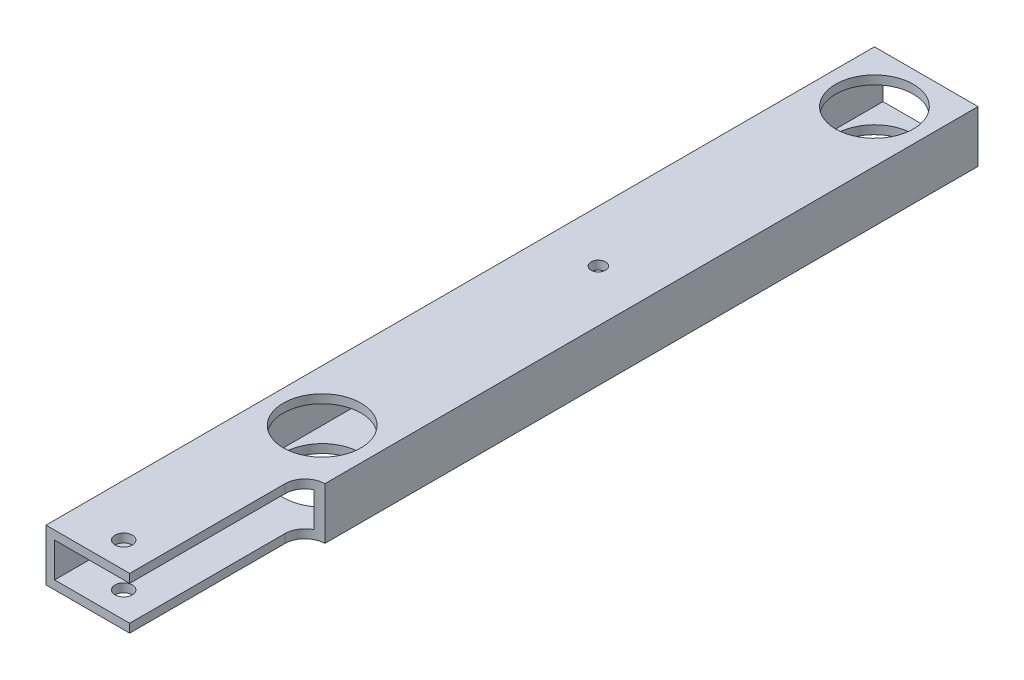
ISO-10303-21;
HEADER;
FILE_DESCRIPTION(('STEP AP214'),'2;1');
FILE_NAME('part.step','',(''),(''),'','','');
FILE_SCHEMA(('AUTOMOTIVE_DESIGN { 1 0 10303 214 1 1 1 1 }'));
ENDSEC;
DATA;
#1=APPLICATION_CONTEXT('core data for automotive mechanical design processes');
#2=APPLICATION_PROTOCOL_DEFINITION('international standard','automotive_design',2000,#1);
#3=PRODUCT_CONTEXT('',#1,'mechanical');
#4=PRODUCT('Part','Part','',(#3));
#5=PRODUCT_RELATED_PRODUCT_CATEGORY('part','',(#4));
#6=PRODUCT_DEFINITION_FORMATION('','',#4);
#7=PRODUCT_DEFINITION_CONTEXT('part definition',#1,'design');
#8=PRODUCT_DEFINITION('design','',#6,#7);
#9=PRODUCT_DEFINITION_SHAPE('','',#8);
#10=(LENGTH_UNIT() NAMED_UNIT(*) SI_UNIT(.MILLI.,.METRE.));
#11=(NAMED_UNIT(*) PLANE_ANGLE_UNIT() SI_UNIT($,.RADIAN.));
#12=(NAMED_UNIT(*) SI_UNIT($,.STERADIAN.) SOLID_ANGLE_UNIT());
#13=UNCERTAINTY_MEASURE_WITH_UNIT(LENGTH_MEASURE(1.E-05),#10,'distance_accuracy_value','');
#14=(GEOMETRIC_REPRESENTATION_CONTEXT(3) GLOBAL_UNCERTAINTY_ASSIGNED_CONTEXT((#13)) GLOBAL_UNIT_ASSIGNED_CONTEXT((#10,
#11,#12)) REPRESENTATION_CONTEXT('',''));
#15=CARTESIAN_POINT('',(0.,0.,0.));
#16=DIRECTION('',(0.,0.,1.));
#17=DIRECTION('',(1.,0.,0.));
#18=AXIS2_PLACEMENT_3D('',#15,#16,#17);
#19=CARTESIAN_POINT('',(0.,0.,304.8));
#20=DIRECTION('',(0.,0.,-1.));
#21=DIRECTION('',(-1.,0.,0.));
#22=AXIS2_PLACEMENT_3D('',#19,#20,#21);
#23=PLANE('',#22);
#24=DIRECTION('',(1.,0.,0.));
#25=VECTOR('',#24,1.);
#26=CARTESIAN_POINT('',(0.,0.,304.8));
#27=LINE('',#26,#25);
#28=CARTESIAN_POINT('',(0.,0.,304.8));
#29=VERTEX_POINT('',#28);
#30=CARTESIAN_POINT('',(30.7744642125592,0.,304.8));
#31=VERTEX_POINT('',#30);
#32=EDGE_CURVE('E204',#29,#31,#27,.T.);
#33=ORIENTED_EDGE('',*,*,#32,.T.);
#34=DIRECTION('',(0.,1.,0.));
#35=VECTOR('',#34,1.);
#36=CARTESIAN_POINT('',(30.7744642125592,0.,304.8));
#37=LINE('',#36,#35);
#38=CARTESIAN_POINT('',(30.7744642125592,3.175,304.8));
#39=VERTEX_POINT('',#38);
#40=EDGE_CURVE('E184',#31,#39,#37,.T.);
#41=ORIENTED_EDGE('',*,*,#40,.T.);
#42=DIRECTION('',(1.,0.,0.));
#43=VECTOR('',#42,1.);
#44=CARTESIAN_POINT('',(3.175,3.175,304.8));
#45=LINE('',#44,#43);
#46=CARTESIAN_POINT('',(3.175,3.175,304.8));
#47=VERTEX_POINT('',#46);
#48=EDGE_CURVE('E269',#47,#39,#45,.T.);
#49=ORIENTED_EDGE('',*,*,#48,.F.);
#50=DIRECTION('',(0.,-1.,0.));
#51=VECTOR('',#50,1.);
#52=CARTESIAN_POINT('',(3.175,3.175,304.8));
#53=LINE('',#52,#51);
#54=CARTESIAN_POINT('',(3.175,15.875,304.8));
#55=VERTEX_POINT('',#54);
#56=EDGE_CURVE('E267',#55,#47,#53,.T.);
#57=ORIENTED_EDGE('',*,*,#56,.F.);
#58=DIRECTION('',(-1.,0.,0.));
#59=VECTOR('',#58,1.);
#60=CARTESIAN_POINT('',(3.175,15.875,304.8));
#61=LINE('',#60,#59);
#62=CARTESIAN_POINT('',(30.7744642125592,15.875,304.8));
#63=VERTEX_POINT('',#62);
#64=EDGE_CURVE('E195',#63,#55,#61,.T.);
#65=ORIENTED_EDGE('',*,*,#64,.F.);
#66=CARTESIAN_POINT('',(30.7744642125592,19.05,304.8));
#67=VERTEX_POINT('',#66);
#68=EDGE_CURVE('E231',#63,#67,#37,.T.);
#69=ORIENTED_EDGE('',*,*,#68,.T.);
#70=DIRECTION('',(-1.,0.,0.));
#71=VECTOR('',#70,1.);
#72=CARTESIAN_POINT('',(0.,19.05,304.8));
#73=LINE('',#72,#71);
#74=CARTESIAN_POINT('',(0.,19.05,304.8));
#75=VERTEX_POINT('',#74);
#76=EDGE_CURVE('E208',#67,#75,#73,.T.);
#77=ORIENTED_EDGE('',*,*,#76,.T.);
#78=DIRECTION('',(0.,-1.,0.));
#79=VECTOR('',#78,1.);
#80=CARTESIAN_POINT('',(0.,0.,304.8));
#81=LINE('',#80,#79);
#82=EDGE_CURVE('E201',#75,#29,#81,.T.);
#83=ORIENTED_EDGE('',*,*,#82,.T.);
#84=EDGE_LOOP('',(#33,#41,#49,#57,#65,#69,#77,#83));
#85=FACE_BOUND('',#84,.T.);
#86=ADVANCED_FACE('F33',(#85),#23,.F.);
#87=CARTESIAN_POINT('',(0.,0.,0.));
#88=DIRECTION('',(0.,0.,-1.));
#89=DIRECTION('',(-1.,0.,0.));
#90=AXIS2_PLACEMENT_3D('',#87,#88,#89);
#91=PLANE('',#90);
#92=DIRECTION('',(0.,-1.,0.));
#93=VECTOR('',#92,1.);
#94=CARTESIAN_POINT('',(0.,0.,0.));
#95=LINE('',#94,#93);
#96=CARTESIAN_POINT('',(0.,19.05,0.));
#97=VERTEX_POINT('',#96);
#98=CARTESIAN_POINT('',(0.,0.,0.));
#99=VERTEX_POINT('',#98);
#100=EDGE_CURVE('E200',#97,#99,#95,.T.);
#101=ORIENTED_EDGE('',*,*,#100,.F.);
#102=DIRECTION('',(-1.,0.,0.));
#103=VECTOR('',#102,1.);
#104=CARTESIAN_POINT('',(0.,19.05,0.));
#105=LINE('',#104,#103);
#106=CARTESIAN_POINT('',(38.1,19.05,0.));
#107=VERTEX_POINT('',#106);
#108=EDGE_CURVE('E205',#107,#97,#105,.T.);
#109=ORIENTED_EDGE('',*,*,#108,.F.);
#110=DIRECTION('',(0.,1.,0.));
#111=VECTOR('',#110,1.);
#112=CARTESIAN_POINT('',(38.1,0.,0.));
#113=LINE('',#112,#111);
#114=CARTESIAN_POINT('',(38.1,0.,0.));
#115=VERTEX_POINT('',#114);
#116=EDGE_CURVE('E213',#115,#107,#113,.T.);
#117=ORIENTED_EDGE('',*,*,#116,.F.);
#118=DIRECTION('',(1.,0.,0.));
#119=VECTOR('',#118,1.);
#120=CARTESIAN_POINT('',(0.,0.,0.));
#121=LINE('',#120,#119);
#122=EDGE_CURVE('E146',#99,#115,#121,.T.);
#123=ORIENTED_EDGE('',*,*,#122,.F.);
#124=EDGE_LOOP('',(#101,#109,#117,#123));
#125=FACE_BOUND('',#124,.T.);
#126=DIRECTION('',(-1.,0.,0.));
#127=VECTOR('',#126,1.);
#128=CARTESIAN_POINT('',(3.175,15.875,0.));
#129=LINE('',#128,#127);
#130=CARTESIAN_POINT('',(34.925,15.875,0.));
#131=VERTEX_POINT('',#130);
#132=CARTESIAN_POINT('',(3.175,15.875,0.));
#133=VERTEX_POINT('',#132);
#134=EDGE_CURVE('E189',#131,#133,#129,.T.);
#135=ORIENTED_EDGE('',*,*,#134,.T.);
#136=DIRECTION('',(0.,-1.,0.));
#137=VECTOR('',#136,1.);
#138=CARTESIAN_POINT('',(3.175,3.175,0.));
#139=LINE('',#138,#137);
#140=CARTESIAN_POINT('',(3.175,3.175,0.));
#141=VERTEX_POINT('',#140);
#142=EDGE_CURVE('E56',#133,#141,#139,.T.);
#143=ORIENTED_EDGE('',*,*,#142,.T.);
#144=DIRECTION('',(1.,0.,0.));
#145=VECTOR('',#144,1.);
#146=CARTESIAN_POINT('',(3.175,3.175,0.));
#147=LINE('',#146,#145);
#148=CARTESIAN_POINT('',(34.925,3.175,0.));
#149=VERTEX_POINT('',#148);
#150=EDGE_CURVE('E274',#141,#149,#147,.T.);
#151=ORIENTED_EDGE('',*,*,#150,.T.);
#152=DIRECTION('',(0.,1.,0.));
#153=VECTOR('',#152,1.);
#154=CARTESIAN_POINT('',(34.925,3.175,0.));
#155=LINE('',#154,#153);
#156=EDGE_CURVE('E277',#149,#131,#155,.T.);
#157=ORIENTED_EDGE('',*,*,#156,.T.);
#158=EDGE_LOOP('',(#135,#143,#151,#157));
#159=FACE_BOUND('',#158,.T.);
#160=ADVANCED_FACE('F225',(#125,#159),#91,.T.);
#161=CARTESIAN_POINT('',(0.,0.,304.8));
#162=DIRECTION('',(1.,0.,0.));
#163=DIRECTION('',(0.,0.,-1.));
#164=AXIS2_PLACEMENT_3D('',#161,#162,#163);
#165=PLANE('',#164);
#166=ORIENTED_EDGE('',*,*,#100,.T.);
#167=DIRECTION('',(0.,0.,-1.));
#168=VECTOR('',#167,1.);
#169=CARTESIAN_POINT('',(0.,0.,304.8));
#170=LINE('',#169,#168);
#171=EDGE_CURVE('E148',#29,#99,#170,.T.);
#172=ORIENTED_EDGE('',*,*,#171,.F.);
#173=ORIENTED_EDGE('',*,*,#82,.F.);
#174=DIRECTION('',(0.,0.,-1.));
#175=VECTOR('',#174,1.);
#176=CARTESIAN_POINT('',(0.,19.05,304.8));
#177=LINE('',#176,#175);
#178=EDGE_CURVE('E151',#75,#97,#177,.T.);
#179=ORIENTED_EDGE('',*,*,#178,.T.);
#180=EDGE_LOOP('',(#166,#172,#173,#179));
#181=FACE_BOUND('',#180,.T.);
#182=ADVANCED_FACE('F35',(#181),#165,.F.);
#183=CARTESIAN_POINT('',(0.,0.,304.8));
#184=DIRECTION('',(0.,1.,0.));
#185=DIRECTION('',(0.,0.,1.));
#186=AXIS2_PLACEMENT_3D('',#183,#184,#185);
#187=PLANE('',#186);
#188=CARTESIAN_POINT('',(19.0500000000044,0.,120.650000000001));
#189=DIRECTION('',(0.,-1.,0.));
#190=DIRECTION('',(0.,0.,-1.));
#191=AXIS2_PLACEMENT_3D('',#188,#189,#190);
#192=CIRCLE('',#191,6.3499999999956);
#193=CARTESIAN_POINT('',(19.0500000000044,0.,114.300000000005));
#194=VERTEX_POINT('',#193);
#195=EDGE_CURVE('E292',#194,#194,#192,.T.);
#196=ORIENTED_EDGE('',*,*,#195,.F.);
#197=EDGE_LOOP('',(#196));
#198=FACE_BOUND('',#197,.T.);
#199=CARTESIAN_POINT('',(19.05,0.,295.275));
#200=DIRECTION('',(0.,1.,0.));
#201=DIRECTION('',(0.,0.,1.));
#202=AXIS2_PLACEMENT_3D('',#199,#200,#201);
#203=CIRCLE('',#202,3.17499999999998);
#204=CARTESIAN_POINT('',(19.05,0.,298.45));
#205=VERTEX_POINT('',#204);
#206=EDGE_CURVE('E168',#205,#205,#203,.T.);
#207=ORIENTED_EDGE('',*,*,#206,.T.);
#208=EDGE_LOOP('',(#207));
#209=FACE_BOUND('',#208,.T.);
#210=CARTESIAN_POINT('',(19.05,0.,19.05));
#211=DIRECTION('',(0.,1.,0.));
#212=DIRECTION('',(0.,0.,1.));
#213=AXIS2_PLACEMENT_3D('',#210,#211,#212);
#214=CIRCLE('',#213,14.2875);
#215=CARTESIAN_POINT('',(19.05,0.,33.3375));
#216=VERTEX_POINT('',#215);
#217=EDGE_CURVE('E159',#216,#216,#214,.T.);
#218=ORIENTED_EDGE('',*,*,#217,.T.);
#219=EDGE_LOOP('',(#218));
#220=FACE_BOUND('',#219,.T.);
#221=CARTESIAN_POINT('',(19.05,0.,222.25));
#222=DIRECTION('',(0.,1.,0.));
#223=DIRECTION('',(0.,0.,1.));
#224=AXIS2_PLACEMENT_3D('',#221,#222,#223);
#225=CIRCLE('',#224,14.2875);
#226=CARTESIAN_POINT('',(19.05,0.,236.5375));
#227=VERTEX_POINT('',#226);
#228=EDGE_CURVE('E258',#227,#227,#225,.T.);
#229=ORIENTED_EDGE('',*,*,#228,.T.);
#230=EDGE_LOOP('',(#229));
#231=FACE_BOUND('',#230,.T.);
#232=CARTESIAN_POINT('',(38.1,0.,247.65));
#233=DIRECTION('',(0.,1.,0.));
#234=DIRECTION('',(0.,0.,1.));
#235=AXIS2_PLACEMENT_3D('',#232,#233,#234);
#236=CIRCLE('',#235,7.3255357874408);
#237=CARTESIAN_POINT('',(38.1,0.,240.324464212559));
#238=VERTEX_POINT('',#237);
#239=CARTESIAN_POINT('',(30.7744642125592,0.,247.65));
#240=VERTEX_POINT('',#239);
#241=EDGE_CURVE('E122',#238,#240,#236,.T.);
#242=ORIENTED_EDGE('',*,*,#241,.T.);
#243=DIRECTION('',(0.,0.,1.));
#244=VECTOR('',#243,1.);
#245=CARTESIAN_POINT('',(30.7744642125592,0.,304.8));
#246=LINE('',#245,#244);
#247=EDGE_CURVE('E133',#240,#31,#246,.T.);
#248=ORIENTED_EDGE('',*,*,#247,.T.);
#249=ORIENTED_EDGE('',*,*,#32,.F.);
#250=ORIENTED_EDGE('',*,*,#171,.T.);
#251=ORIENTED_EDGE('',*,*,#122,.T.);
#252=DIRECTION('',(0.,0.,-1.));
#253=VECTOR('',#252,1.);
#254=CARTESIAN_POINT('',(38.1,0.,304.8));
#255=LINE('',#254,#253);
#256=EDGE_CURVE('E140',#238,#115,#255,.T.);
#257=ORIENTED_EDGE('',*,*,#256,.F.);
#258=EDGE_LOOP('',(#242,#248,#249,#250,#251,#257));
#259=FACE_BOUND('',#258,.T.);
#260=ADVANCED_FACE('F144',(#198,#209,#220,#231,#259),#187,.F.);
#261=CARTESIAN_POINT('',(38.1,0.,304.8));
#262=DIRECTION('',(-1.,0.,0.));
#263=DIRECTION('',(0.,0.,1.));
#264=AXIS2_PLACEMENT_3D('',#261,#262,#263);
#265=PLANE('',#264);
#266=DIRECTION('',(0.,0.,-1.));
#267=VECTOR('',#266,1.);
#268=CARTESIAN_POINT('',(38.1,19.05,304.8));
#269=LINE('',#268,#267);
#270=CARTESIAN_POINT('',(38.1,19.05,240.324464212559));
#271=VERTEX_POINT('',#270);
#272=EDGE_CURVE('E142',#271,#107,#269,.T.);
#273=ORIENTED_EDGE('',*,*,#272,.F.);
#274=DIRECTION('',(0.,1.,0.));
#275=VECTOR('',#274,1.);
#276=CARTESIAN_POINT('',(38.1,0.,240.324464212559));
#277=LINE('',#276,#275);
#278=EDGE_CURVE('E125',#238,#271,#277,.T.);
#279=ORIENTED_EDGE('',*,*,#278,.F.);
#280=ORIENTED_EDGE('',*,*,#256,.T.);
#281=ORIENTED_EDGE('',*,*,#116,.T.);
#282=EDGE_LOOP('',(#273,#279,#280,#281));
#283=FACE_BOUND('',#282,.T.);
#284=ADVANCED_FACE('F138',(#283),#265,.F.);
#285=CARTESIAN_POINT('',(0.,19.05,304.8));
#286=DIRECTION('',(0.,-1.,0.));
#287=DIRECTION('',(0.,0.,-1.));
#288=AXIS2_PLACEMENT_3D('',#285,#286,#287);
#289=PLANE('',#288);
#290=CARTESIAN_POINT('',(19.0500000000044,19.05,120.650000000001));
#291=DIRECTION('',(0.,1.,0.));
#292=DIRECTION('',(0.,0.,1.));
#293=AXIS2_PLACEMENT_3D('',#290,#291,#292);
#294=CIRCLE('',#293,2.66699999999594);
#295=CARTESIAN_POINT('',(19.0500000000044,19.05,123.316999999997));
#296=VERTEX_POINT('',#295);
#297=EDGE_CURVE('E289',#296,#296,#294,.T.);
#298=ORIENTED_EDGE('',*,*,#297,.F.);
#299=EDGE_LOOP('',(#298));
#300=FACE_BOUND('',#299,.T.);
#301=CARTESIAN_POINT('',(19.05,19.05,295.275));
#302=DIRECTION('',(0.,1.,0.));
#303=DIRECTION('',(0.,0.,1.));
#304=AXIS2_PLACEMENT_3D('',#301,#302,#303);
#305=CIRCLE('',#304,3.17499999999998);
#306=CARTESIAN_POINT('',(19.05,19.05,298.45));
#307=VERTEX_POINT('',#306);
#308=EDGE_CURVE('E245',#307,#307,#305,.T.);
#309=ORIENTED_EDGE('',*,*,#308,.F.);
#310=EDGE_LOOP('',(#309));
#311=FACE_BOUND('',#310,.T.);
#312=CARTESIAN_POINT('',(19.05,19.05,19.05));
#313=DIRECTION('',(0.,1.,0.));
#314=DIRECTION('',(0.,0.,1.));
#315=AXIS2_PLACEMENT_3D('',#312,#313,#314);
#316=CIRCLE('',#315,14.2875);
#317=CARTESIAN_POINT('',(19.05,19.05,33.3375));
#318=VERTEX_POINT('',#317);
#319=EDGE_CURVE('E255',#318,#318,#316,.T.);
#320=ORIENTED_EDGE('',*,*,#319,.F.);
#321=EDGE_LOOP('',(#320));
#322=FACE_BOUND('',#321,.T.);
#323=CARTESIAN_POINT('',(19.05,19.05,222.25));
#324=DIRECTION('',(0.,1.,0.));
#325=DIRECTION('',(0.,0.,1.));
#326=AXIS2_PLACEMENT_3D('',#323,#324,#325);
#327=CIRCLE('',#326,14.2875);
#328=CARTESIAN_POINT('',(19.05,19.05,236.5375));
#329=VERTEX_POINT('',#328);
#330=EDGE_CURVE('E252',#329,#329,#327,.T.);
#331=ORIENTED_EDGE('',*,*,#330,.F.);
#332=EDGE_LOOP('',(#331));
#333=FACE_BOUND('',#332,.T.);
#334=ORIENTED_EDGE('',*,*,#76,.F.);
#335=DIRECTION('',(0.,0.,1.));
#336=VECTOR('',#335,1.);
#337=CARTESIAN_POINT('',(30.7744642125592,19.05,304.8));
#338=LINE('',#337,#336);
#339=CARTESIAN_POINT('',(30.7744642125592,19.05,247.65));
#340=VERTEX_POINT('',#339);
#341=EDGE_CURVE('E134',#340,#67,#338,.T.);
#342=ORIENTED_EDGE('',*,*,#341,.F.);
#343=CARTESIAN_POINT('',(38.1,19.05,247.65));
#344=DIRECTION('',(0.,1.,0.));
#345=DIRECTION('',(0.,0.,1.));
#346=AXIS2_PLACEMENT_3D('',#343,#344,#345);
#347=CIRCLE('',#346,7.3255357874408);
#348=EDGE_CURVE('E234',#271,#340,#347,.T.);
#349=ORIENTED_EDGE('',*,*,#348,.F.);
#350=ORIENTED_EDGE('',*,*,#272,.T.);
#351=ORIENTED_EDGE('',*,*,#108,.T.);
#352=ORIENTED_EDGE('',*,*,#178,.F.);
#353=EDGE_LOOP('',(#334,#342,#349,#350,#351,#352));
#354=FACE_BOUND('',#353,.T.);
#355=ADVANCED_FACE('F233',(#300,#311,#322,#333,#354),#289,.F.);
#356=CARTESIAN_POINT('',(3.175,3.175,304.8));
#357=DIRECTION('',(1.,0.,0.));
#358=DIRECTION('',(0.,0.,-1.));
#359=AXIS2_PLACEMENT_3D('',#356,#357,#358);
#360=PLANE('',#359);
#361=ORIENTED_EDGE('',*,*,#142,.F.);
#362=DIRECTION('',(0.,0.,-1.));
#363=VECTOR('',#362,1.);
#364=CARTESIAN_POINT('',(3.175,15.875,304.8));
#365=LINE('',#364,#363);
#366=EDGE_CURVE('E191',#55,#133,#365,.T.);
#367=ORIENTED_EDGE('',*,*,#366,.F.);
#368=ORIENTED_EDGE('',*,*,#56,.T.);
#369=DIRECTION('',(0.,0.,-1.));
#370=VECTOR('',#369,1.);
#371=CARTESIAN_POINT('',(3.175,3.175,304.8));
#372=LINE('',#371,#370);
#373=EDGE_CURVE('E193',#47,#141,#372,.T.);
#374=ORIENTED_EDGE('',*,*,#373,.T.);
#375=EDGE_LOOP('',(#361,#367,#368,#374));
#376=FACE_BOUND('',#375,.T.);
#377=ADVANCED_FACE('F284',(#376),#360,.T.);
#378=CARTESIAN_POINT('',(3.175,3.175,304.8));
#379=DIRECTION('',(0.,1.,0.));
#380=DIRECTION('',(0.,0.,1.));
#381=AXIS2_PLACEMENT_3D('',#378,#379,#380);
#382=PLANE('',#381);
#383=CARTESIAN_POINT('',(19.0500000000044,3.175,120.650000000001));
#384=DIRECTION('',(0.,1.,0.));
#385=DIRECTION('',(0.,0.,1.));
#386=AXIS2_PLACEMENT_3D('',#383,#384,#385);
#387=CIRCLE('',#386,6.3499999999956);
#388=CARTESIAN_POINT('',(19.0500000000044,3.175,126.999999999996));
#389=VERTEX_POINT('',#388);
#390=EDGE_CURVE('E293',#389,#389,#387,.F.);
#391=ORIENTED_EDGE('',*,*,#390,.T.);
#392=EDGE_LOOP('',(#391));
#393=FACE_BOUND('',#392,.T.);
#394=DIRECTION('',(0.,0.,1.));
#395=VECTOR('',#394,1.);
#396=CARTESIAN_POINT('',(30.7744642125592,3.175,304.8));
#397=LINE('',#396,#395);
#398=CARTESIAN_POINT('',(30.7744642125592,3.175,247.65));
#399=VERTEX_POINT('',#398);
#400=EDGE_CURVE('E243',#399,#39,#397,.T.);
#401=ORIENTED_EDGE('',*,*,#400,.F.);
#402=CARTESIAN_POINT('',(38.1,3.175,247.65));
#403=DIRECTION('',(0.,1.,0.));
#404=DIRECTION('',(0.,0.,1.));
#405=AXIS2_PLACEMENT_3D('',#402,#403,#404);
#406=CIRCLE('',#405,7.3255357874408);
#407=CARTESIAN_POINT('',(34.925,3.175,241.048269198682));
#408=VERTEX_POINT('',#407);
#409=EDGE_CURVE('E183',#408,#399,#406,.T.);
#410=ORIENTED_EDGE('',*,*,#409,.F.);
#411=DIRECTION('',(0.,0.,-1.));
#412=VECTOR('',#411,1.);
#413=CARTESIAN_POINT('',(34.925,3.175,304.8));
#414=LINE('',#413,#412);
#415=EDGE_CURVE('E182',#408,#149,#414,.T.);
#416=ORIENTED_EDGE('',*,*,#415,.T.);
#417=ORIENTED_EDGE('',*,*,#150,.F.);
#418=ORIENTED_EDGE('',*,*,#373,.F.);
#419=ORIENTED_EDGE('',*,*,#48,.T.);
#420=EDGE_LOOP('',(#401,#410,#416,#417,#418,#419));
#421=FACE_BOUND('',#420,.T.);
#422=CARTESIAN_POINT('',(19.05,3.175,295.275));
#423=DIRECTION('',(0.,1.,0.));
#424=DIRECTION('',(0.,0.,1.));
#425=AXIS2_PLACEMENT_3D('',#422,#423,#424);
#426=CIRCLE('',#425,3.17499999999998);
#427=CARTESIAN_POINT('',(19.05,3.175,298.45));
#428=VERTEX_POINT('',#427);
#429=EDGE_CURVE('E167',#428,#428,#426,.T.);
#430=ORIENTED_EDGE('',*,*,#429,.F.);
#431=EDGE_LOOP('',(#430));
#432=FACE_BOUND('',#431,.T.);
#433=CARTESIAN_POINT('',(19.05,3.175,19.05));
#434=DIRECTION('',(0.,1.,0.));
#435=DIRECTION('',(0.,0.,1.));
#436=AXIS2_PLACEMENT_3D('',#433,#434,#435);
#437=CIRCLE('',#436,14.2875);
#438=CARTESIAN_POINT('',(19.05,3.175,33.3375));
#439=VERTEX_POINT('',#438);
#440=EDGE_CURVE('E163',#439,#439,#437,.T.);
#441=ORIENTED_EDGE('',*,*,#440,.F.);
#442=EDGE_LOOP('',(#441));
#443=FACE_BOUND('',#442,.T.);
#444=CARTESIAN_POINT('',(19.05,3.175,222.25));
#445=DIRECTION('',(0.,1.,0.));
#446=DIRECTION('',(0.,0.,1.));
#447=AXIS2_PLACEMENT_3D('',#444,#445,#446);
#448=CIRCLE('',#447,14.2875);
#449=CARTESIAN_POINT('',(19.05,3.175,236.5375));
#450=VERTEX_POINT('',#449);
#451=EDGE_CURVE('E158',#450,#450,#448,.T.);
#452=ORIENTED_EDGE('',*,*,#451,.F.);
#453=EDGE_LOOP('',(#452));
#454=FACE_BOUND('',#453,.T.);
#455=ADVANCED_FACE('F281',(#393,#421,#432,#443,#454),#382,.T.);
#456=CARTESIAN_POINT('',(34.925,3.175,304.8));
#457=DIRECTION('',(-1.,0.,0.));
#458=DIRECTION('',(0.,0.,1.));
#459=AXIS2_PLACEMENT_3D('',#456,#457,#458);
#460=PLANE('',#459);
#461=DIRECTION('',(0.,1.,0.));
#462=VECTOR('',#461,1.);
#463=CARTESIAN_POINT('',(34.925,0.,241.048269198682));
#464=LINE('',#463,#462);
#465=CARTESIAN_POINT('',(34.925,15.875,241.048269198682));
#466=VERTEX_POINT('',#465);
#467=EDGE_CURVE('E171',#466,#408,#464,.F.);
#468=ORIENTED_EDGE('',*,*,#467,.F.);
#469=DIRECTION('',(0.,0.,-1.));
#470=VECTOR('',#469,1.);
#471=CARTESIAN_POINT('',(34.925,15.875,304.8));
#472=LINE('',#471,#470);
#473=EDGE_CURVE('E180',#466,#131,#472,.T.);
#474=ORIENTED_EDGE('',*,*,#473,.T.);
#475=ORIENTED_EDGE('',*,*,#156,.F.);
#476=ORIENTED_EDGE('',*,*,#415,.F.);
#477=EDGE_LOOP('',(#468,#474,#475,#476));
#478=FACE_BOUND('',#477,.T.);
#479=ADVANCED_FACE('F178',(#478),#460,.T.);
#480=CARTESIAN_POINT('',(3.175,15.875,304.8));
#481=DIRECTION('',(0.,-1.,0.));
#482=DIRECTION('',(0.,0.,-1.));
#483=AXIS2_PLACEMENT_3D('',#480,#481,#482);
#484=PLANE('',#483);
#485=CARTESIAN_POINT('',(19.0500000000044,15.875,120.650000000001));
#486=DIRECTION('',(0.,-1.,0.));
#487=DIRECTION('',(0.,0.,-1.));
#488=AXIS2_PLACEMENT_3D('',#485,#486,#487);
#489=CIRCLE('',#488,2.66699999999594);
#490=CARTESIAN_POINT('',(19.0500000000044,15.875,117.983000000005));
#491=VERTEX_POINT('',#490);
#492=EDGE_CURVE('E37',#491,#491,#489,.T.);
#493=ORIENTED_EDGE('',*,*,#492,.F.);
#494=EDGE_LOOP('',(#493));
#495=FACE_BOUND('',#494,.T.);
#496=DIRECTION('',(0.,0.,-1.));
#497=VECTOR('',#496,1.);
#498=CARTESIAN_POINT('',(30.7744642125592,15.875,304.8));
#499=LINE('',#498,#497);
#500=CARTESIAN_POINT('',(30.7744642125592,15.875,247.65));
#501=VERTEX_POINT('',#500);
#502=EDGE_CURVE('E11',#63,#501,#499,.T.);
#503=ORIENTED_EDGE('',*,*,#502,.F.);
#504=ORIENTED_EDGE('',*,*,#64,.T.);
#505=ORIENTED_EDGE('',*,*,#366,.T.);
#506=ORIENTED_EDGE('',*,*,#134,.F.);
#507=ORIENTED_EDGE('',*,*,#473,.F.);
#508=CARTESIAN_POINT('',(38.1,15.875,247.65));
#509=DIRECTION('',(0.,-1.,0.));
#510=DIRECTION('',(0.,0.,-1.));
#511=AXIS2_PLACEMENT_3D('',#508,#509,#510);
#512=CIRCLE('',#511,7.3255357874408);
#513=EDGE_CURVE('E42',#501,#466,#512,.T.);
#514=ORIENTED_EDGE('',*,*,#513,.F.);
#515=EDGE_LOOP('',(#503,#504,#505,#506,#507,#514));
#516=FACE_BOUND('',#515,.T.);
#517=CARTESIAN_POINT('',(19.05,15.875,295.275));
#518=DIRECTION('',(0.,-1.,0.));
#519=DIRECTION('',(0.,0.,-1.));
#520=AXIS2_PLACEMENT_3D('',#517,#518,#519);
#521=CIRCLE('',#520,3.17499999999998);
#522=CARTESIAN_POINT('',(19.05,15.875,292.1));
#523=VERTEX_POINT('',#522);
#524=EDGE_CURVE('E164',#523,#523,#521,.T.);
#525=ORIENTED_EDGE('',*,*,#524,.F.);
#526=EDGE_LOOP('',(#525));
#527=FACE_BOUND('',#526,.T.);
#528=CARTESIAN_POINT('',(19.05,15.875,19.05));
#529=DIRECTION('',(0.,-1.,0.));
#530=DIRECTION('',(0.,0.,-1.));
#531=AXIS2_PLACEMENT_3D('',#528,#529,#530);
#532=CIRCLE('',#531,14.2875);
#533=CARTESIAN_POINT('',(19.05,15.875,4.76249999999999));
#534=VERTEX_POINT('',#533);
#535=EDGE_CURVE('E160',#534,#534,#532,.T.);
#536=ORIENTED_EDGE('',*,*,#535,.F.);
#537=EDGE_LOOP('',(#536));
#538=FACE_BOUND('',#537,.T.);
#539=CARTESIAN_POINT('',(19.05,15.875,222.25));
#540=DIRECTION('',(0.,-1.,0.));
#541=DIRECTION('',(0.,0.,-1.));
#542=AXIS2_PLACEMENT_3D('',#539,#540,#541);
#543=CIRCLE('',#542,14.2875);
#544=CARTESIAN_POINT('',(19.05,15.875,207.9625));
#545=VERTEX_POINT('',#544);
#546=EDGE_CURVE('E155',#545,#545,#543,.T.);
#547=ORIENTED_EDGE('',*,*,#546,.F.);
#548=EDGE_LOOP('',(#547));
#549=FACE_BOUND('',#548,.T.);
#550=ADVANCED_FACE('F186',(#495,#516,#527,#538,#549),#484,.T.);
#551=CARTESIAN_POINT('',(19.05,0.,222.25));
#552=DIRECTION('',(0.,1.,0.));
#553=DIRECTION('',(0.,0.,1.));
#554=AXIS2_PLACEMENT_3D('',#551,#552,#553);
#555=CYLINDRICAL_SURFACE('',#554,14.2875);
#556=ORIENTED_EDGE('',*,*,#546,.T.);
#557=EDGE_LOOP('',(#556));
#558=FACE_BOUND('',#557,.T.);
#559=ORIENTED_EDGE('',*,*,#330,.T.);
#560=EDGE_LOOP('',(#559));
#561=FACE_BOUND('',#560,.T.);
#562=ADVANCED_FACE('F315',(#558,#561),#555,.F.);
#563=CARTESIAN_POINT('',(19.05,0.,19.05));
#564=DIRECTION('',(0.,1.,0.));
#565=DIRECTION('',(0.,0.,1.));
#566=AXIS2_PLACEMENT_3D('',#563,#564,#565);
#567=CYLINDRICAL_SURFACE('',#566,14.2875);
#568=ORIENTED_EDGE('',*,*,#535,.T.);
#569=EDGE_LOOP('',(#568));
#570=FACE_BOUND('',#569,.T.);
#571=ORIENTED_EDGE('',*,*,#319,.T.);
#572=EDGE_LOOP('',(#571));
#573=FACE_BOUND('',#572,.T.);
#574=ADVANCED_FACE('F312',(#570,#573),#567,.F.);
#575=ORIENTED_EDGE('',*,*,#451,.T.);
#576=EDGE_LOOP('',(#575));
#577=FACE_BOUND('',#576,.T.);
#578=ORIENTED_EDGE('',*,*,#228,.F.);
#579=EDGE_LOOP('',(#578));
#580=FACE_BOUND('',#579,.T.);
#581=ADVANCED_FACE('F309',(#577,#580),#555,.F.);
#582=ORIENTED_EDGE('',*,*,#440,.T.);
#583=EDGE_LOOP('',(#582));
#584=FACE_BOUND('',#583,.T.);
#585=ORIENTED_EDGE('',*,*,#217,.F.);
#586=EDGE_LOOP('',(#585));
#587=FACE_BOUND('',#586,.T.);
#588=ADVANCED_FACE('F311',(#584,#587),#567,.F.);
#589=CARTESIAN_POINT('',(19.05,0.,295.275));
#590=DIRECTION('',(0.,1.,0.));
#591=DIRECTION('',(0.,0.,1.));
#592=AXIS2_PLACEMENT_3D('',#589,#590,#591);
#593=CYLINDRICAL_SURFACE('',#592,3.17499999999998);
#594=ORIENTED_EDGE('',*,*,#524,.T.);
#595=EDGE_LOOP('',(#594));
#596=FACE_BOUND('',#595,.T.);
#597=ORIENTED_EDGE('',*,*,#308,.T.);
#598=EDGE_LOOP('',(#597));
#599=FACE_BOUND('',#598,.T.);
#600=ADVANCED_FACE('F320',(#596,#599),#593,.F.);
#601=ORIENTED_EDGE('',*,*,#429,.T.);
#602=EDGE_LOOP('',(#601));
#603=FACE_BOUND('',#602,.T.);
#604=ORIENTED_EDGE('',*,*,#206,.F.);
#605=EDGE_LOOP('',(#604));
#606=FACE_BOUND('',#605,.T.);
#607=ADVANCED_FACE('F404',(#603,#606),#593,.F.);
#608=CARTESIAN_POINT('',(30.7744642125592,0.,304.8));
#609=DIRECTION('',(-1.,0.,0.));
#610=DIRECTION('',(0.,0.,1.));
#611=AXIS2_PLACEMENT_3D('',#608,#609,#610);
#612=PLANE('',#611);
#613=ORIENTED_EDGE('',*,*,#400,.T.);
#614=ORIENTED_EDGE('',*,*,#40,.F.);
#615=ORIENTED_EDGE('',*,*,#247,.F.);
#616=DIRECTION('',(0.,1.,0.));
#617=VECTOR('',#616,1.);
#618=CARTESIAN_POINT('',(30.7744642125592,0.,247.65));
#619=LINE('',#618,#617);
#620=EDGE_CURVE('E128',#240,#399,#619,.T.);
#621=ORIENTED_EDGE('',*,*,#620,.T.);
#622=EDGE_LOOP('',(#613,#614,#615,#621));
#623=FACE_BOUND('',#622,.T.);
#624=ADVANCED_FACE('F287',(#623),#612,.F.);
#625=ORIENTED_EDGE('',*,*,#502,.T.);
#626=EDGE_CURVE('E49',#501,#340,#619,.T.);
#627=ORIENTED_EDGE('',*,*,#626,.T.);
#628=ORIENTED_EDGE('',*,*,#341,.T.);
#629=ORIENTED_EDGE('',*,*,#68,.F.);
#630=EDGE_LOOP('',(#625,#627,#628,#629));
#631=FACE_BOUND('',#630,.T.);
#632=ADVANCED_FACE('F473',(#631),#612,.F.);
#633=CARTESIAN_POINT('',(38.1,0.,247.65));
#634=DIRECTION('',(0.,1.,0.));
#635=DIRECTION('',(0.,0.,1.));
#636=AXIS2_PLACEMENT_3D('',#633,#634,#635);
#637=CYLINDRICAL_SURFACE('',#636,7.3255357874408);
#638=ORIENTED_EDGE('',*,*,#409,.T.);
#639=ORIENTED_EDGE('',*,*,#620,.F.);
#640=ORIENTED_EDGE('',*,*,#241,.F.);
#641=ORIENTED_EDGE('',*,*,#278,.T.);
#642=ORIENTED_EDGE('',*,*,#348,.T.);
#643=ORIENTED_EDGE('',*,*,#626,.F.);
#644=ORIENTED_EDGE('',*,*,#513,.T.);
#645=ORIENTED_EDGE('',*,*,#467,.T.);
#646=EDGE_LOOP('',(#638,#639,#640,#641,#642,#643,#644,#645));
#647=FACE_BOUND('',#646,.T.);
#648=ADVANCED_FACE('F124',(#647),#637,.F.);
#649=CARTESIAN_POINT('',(19.0500000000044,0.,120.650000000001));
#650=DIRECTION('',(0.,1.,0.));
#651=DIRECTION('',(0.,0.,1.));
#652=AXIS2_PLACEMENT_3D('',#649,#650,#651);
#653=CYLINDRICAL_SURFACE('',#652,2.66699999999594);
#654=ORIENTED_EDGE('',*,*,#492,.T.);
#655=EDGE_LOOP('',(#654));
#656=FACE_BOUND('',#655,.T.);
#657=ORIENTED_EDGE('',*,*,#297,.T.);
#658=EDGE_LOOP('',(#657));
#659=FACE_BOUND('',#658,.T.);
#660=ADVANCED_FACE('F450',(#656,#659),#653,.F.);
#661=CARTESIAN_POINT('',(19.0500000000044,19.051,120.650000000001));
#662=DIRECTION('',(0.,-1.,0.));
#663=DIRECTION('',(0.,0.,-1.));
#664=AXIS2_PLACEMENT_3D('',#661,#662,#663);
#665=CYLINDRICAL_SURFACE('',#664,6.3499999999956);
#666=ORIENTED_EDGE('',*,*,#390,.F.);
#667=EDGE_LOOP('',(#666));
#668=FACE_BOUND('',#667,.T.);
#669=ORIENTED_EDGE('',*,*,#195,.T.);
#670=EDGE_LOOP('',(#669));
#671=FACE_BOUND('',#670,.T.);
#672=ADVANCED_FACE('F299',(#668,#671),#665,.F.);
#673=CLOSED_SHELL('',(#86,#160,#182,#260,#284,#355,#377,#455,#479,#550,#562,#574,#581,#588,#600,
#607,#624,#632,#648,#660,#672));
#674=MANIFOLD_SOLID_BREP('B2',#673);
#675=ADVANCED_BREP_SHAPE_REPRESENTATION('',(#18,#674),#14);
#676=SHAPE_DEFINITION_REPRESENTATION(#9,#675);
ENDSEC;
END-ISO-10303-21;
